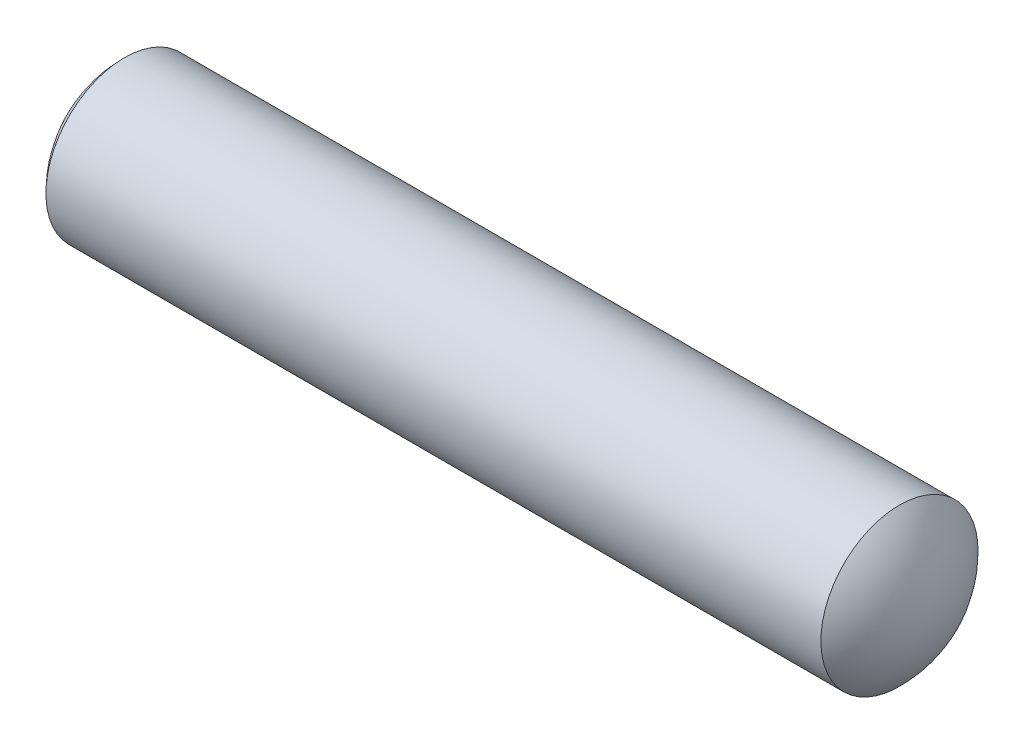
ISO-10303-21;
HEADER;
FILE_DESCRIPTION(('STEP AP214'),'2;1');
FILE_NAME('part.step','',(''),(''),'','','');
FILE_SCHEMA(('AUTOMOTIVE_DESIGN { 1 0 10303 214 1 1 1 1 }'));
ENDSEC;
DATA;
#1=APPLICATION_CONTEXT('core data for automotive mechanical design processes');
#2=APPLICATION_PROTOCOL_DEFINITION('international standard','automotive_design',2000,#1);
#3=PRODUCT_CONTEXT('',#1,'mechanical');
#4=PRODUCT('Part','Part','',(#3));
#5=PRODUCT_RELATED_PRODUCT_CATEGORY('part','',(#4));
#6=PRODUCT_DEFINITION_FORMATION('','',#4);
#7=PRODUCT_DEFINITION_CONTEXT('part definition',#1,'design');
#8=PRODUCT_DEFINITION('design','',#6,#7);
#9=PRODUCT_DEFINITION_SHAPE('','',#8);
#10=(LENGTH_UNIT() NAMED_UNIT(*) SI_UNIT(.MILLI.,.METRE.));
#11=(NAMED_UNIT(*) PLANE_ANGLE_UNIT() SI_UNIT($,.RADIAN.));
#12=(NAMED_UNIT(*) SI_UNIT($,.STERADIAN.) SOLID_ANGLE_UNIT());
#13=UNCERTAINTY_MEASURE_WITH_UNIT(LENGTH_MEASURE(1.E-05),#10,'distance_accuracy_value','');
#14=(GEOMETRIC_REPRESENTATION_CONTEXT(3) GLOBAL_UNCERTAINTY_ASSIGNED_CONTEXT((#13)) GLOBAL_UNIT_ASSIGNED_CONTEXT((#10,
#11,#12)) REPRESENTATION_CONTEXT('',''));
#15=CARTESIAN_POINT('',(0.,0.,0.));
#16=DIRECTION('',(0.,0.,1.));
#17=DIRECTION('',(1.,0.,0.));
#18=AXIS2_PLACEMENT_3D('',#15,#16,#17);
#19=CARTESIAN_POINT('',(15.1875,3.03308499069939,21.0955694800874));
#20=DIRECTION('',(0.,-0.989821441880933,0.142314838273284));
#21=DIRECTION('',(1.,0.,0.));
#22=AXIS2_PLACEMENT_3D('',#19,#20,#21);
#23=SPHERICAL_SURFACE('',#22,1.8375);
#24=CARTESIAN_POINT('',(15.1875,3.03308499069939,21.0955694800874));
#25=DIRECTION('',(-1.,0.,0.));
#26=DIRECTION('',(0.,-0.142314838273285,-0.989821441880933));
#27=AXIS2_PLACEMENT_3D('',#24,#25,#26);
#28=SPHERICAL_SURFACE('',#27,1.8375);
#29=CARTESIAN_POINT('',(16.4734821149612,3.03308499069939,21.0955694800874));
#30=DIRECTION('',(-1.,0.,0.));
#31=DIRECTION('',(0.,-0.142314838273285,-0.989821441880933));
#32=AXIS2_PLACEMENT_3D('',#29,#30,#31);
#33=CIRCLE('',#32,1.3125);
#34=CARTESIAN_POINT('',(16.4734821149612,2.8462967654657,19.7964288376187));
#35=VERTEX_POINT('',#34);
#36=EDGE_CURVE('E11',#35,#35,#33,.T.);
#37=ORIENTED_EDGE('',*,*,#36,.F.);
#38=EDGE_LOOP('',(#37));
#39=FACE_BOUND('',#38,.T.);
#40=ADVANCED_FACE('F17',(#39),#28,.T.);
#41=CARTESIAN_POINT('',(10.,3.03308499069939,21.0955694800874));
#42=DIRECTION('',(-1.,0.,0.));
#43=DIRECTION('',(0.,-0.142314838273285,-0.989821441880933));
#44=AXIS2_PLACEMENT_3D('',#41,#42,#43);
#45=CYLINDRICAL_SURFACE('',#44,1.3125);
#46=CARTESIAN_POINT('',(3.52651788503884,3.03308499069939,21.0955694800874));
#47=DIRECTION('',(-1.,0.,0.));
#48=DIRECTION('',(0.,-0.142314838273285,-0.989821441880933));
#49=AXIS2_PLACEMENT_3D('',#46,#47,#48);
#50=CIRCLE('',#49,1.3125);
#51=CARTESIAN_POINT('',(3.52651788503884,2.8462967654657,19.7964288376187));
#52=VERTEX_POINT('',#51);
#53=EDGE_CURVE('E26',#52,#52,#50,.T.);
#54=ORIENTED_EDGE('',*,*,#53,.F.);
#55=EDGE_LOOP('',(#54));
#56=FACE_BOUND('',#55,.T.);
#57=ORIENTED_EDGE('',*,*,#36,.T.);
#58=EDGE_LOOP('',(#57));
#59=FACE_BOUND('',#58,.T.);
#60=ADVANCED_FACE('F51',(#56,#59),#45,.T.);
#61=CARTESIAN_POINT('',(4.8125,3.03308499069939,21.0955694800874));
#62=DIRECTION('',(0.,-0.989821441880933,0.142314838273284));
#63=DIRECTION('',(-1.,0.,0.));
#64=AXIS2_PLACEMENT_3D('',#61,#62,#63);
#65=SPHERICAL_SURFACE('',#64,1.8375);
#66=CARTESIAN_POINT('',(4.8125,3.03308499069939,21.0955694800874));
#67=DIRECTION('',(-1.,0.,0.));
#68=DIRECTION('',(0.,-0.142314838273285,-0.989821441880933));
#69=AXIS2_PLACEMENT_3D('',#66,#67,#68);
#70=SPHERICAL_SURFACE('',#69,1.8375);
#71=ORIENTED_EDGE('',*,*,#53,.T.);
#72=EDGE_LOOP('',(#71));
#73=FACE_BOUND('',#72,.T.);
#74=ADVANCED_FACE('F19',(#73),#70,.T.);
#75=CLOSED_SHELL('',(#40,#60,#74));
#76=MANIFOLD_SOLID_BREP('B1',#75);
#77=ADVANCED_BREP_SHAPE_REPRESENTATION('',(#18,#76),#14);
#78=SHAPE_DEFINITION_REPRESENTATION(#9,#77);
ENDSEC;
END-ISO-10303-21;
